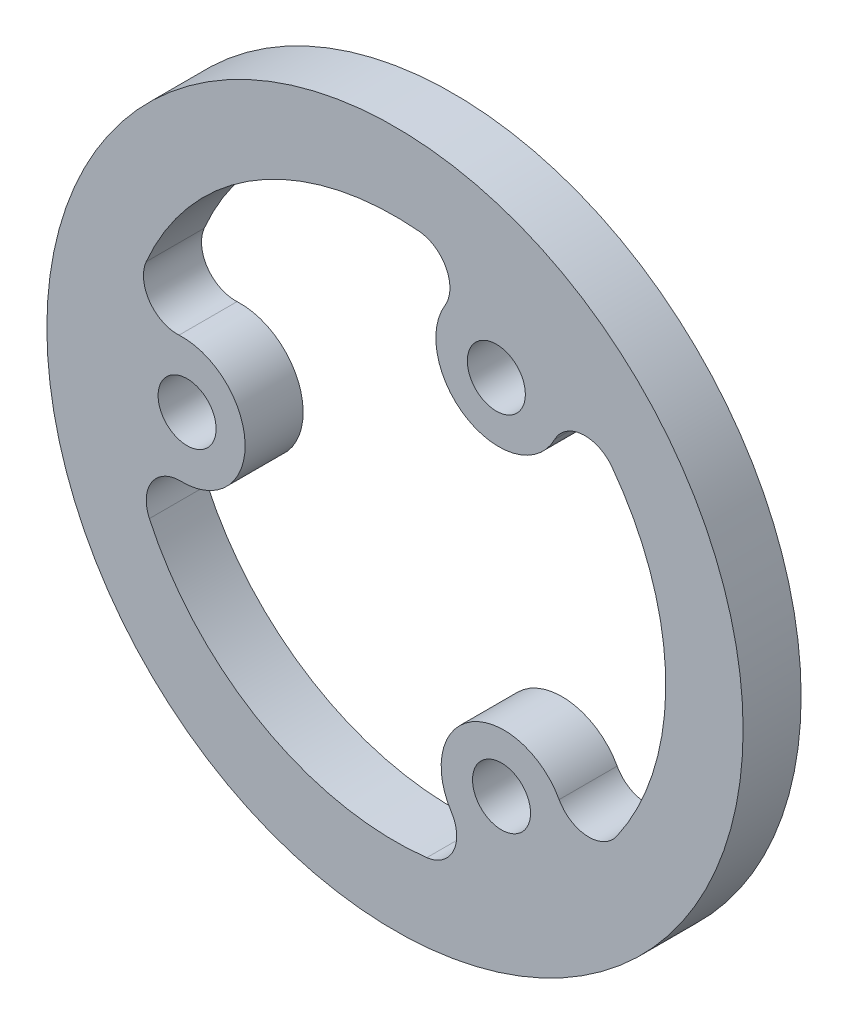
ISO-10303-21;
HEADER;
FILE_DESCRIPTION(('STEP AP214'),'2;1');
FILE_NAME('part.step','',(''),(''),'','','');
FILE_SCHEMA(('AUTOMOTIVE_DESIGN { 1 0 10303 214 1 1 1 1 }'));
ENDSEC;
DATA;
#1=APPLICATION_CONTEXT('core data for automotive mechanical design processes');
#2=APPLICATION_PROTOCOL_DEFINITION('international standard','automotive_design',2000,#1);
#3=PRODUCT_CONTEXT('',#1,'mechanical');
#4=PRODUCT('Part','Part','',(#3));
#5=PRODUCT_RELATED_PRODUCT_CATEGORY('part','',(#4));
#6=PRODUCT_DEFINITION_FORMATION('','',#4);
#7=PRODUCT_DEFINITION_CONTEXT('part definition',#1,'design');
#8=PRODUCT_DEFINITION('design','',#6,#7);
#9=PRODUCT_DEFINITION_SHAPE('','',#8);
#10=(LENGTH_UNIT() NAMED_UNIT(*) SI_UNIT(.MILLI.,.METRE.));
#11=(NAMED_UNIT(*) PLANE_ANGLE_UNIT() SI_UNIT($,.RADIAN.));
#12=(NAMED_UNIT(*) SI_UNIT($,.STERADIAN.) SOLID_ANGLE_UNIT());
#13=UNCERTAINTY_MEASURE_WITH_UNIT(LENGTH_MEASURE(1.E-05),#10,'distance_accuracy_value','');
#14=(GEOMETRIC_REPRESENTATION_CONTEXT(3) GLOBAL_UNCERTAINTY_ASSIGNED_CONTEXT((#13)) GLOBAL_UNIT_ASSIGNED_CONTEXT((#10,
#11,#12)) REPRESENTATION_CONTEXT('',''));
#15=CARTESIAN_POINT('',(0.,0.,0.));
#16=DIRECTION('',(0.,0.,1.));
#17=DIRECTION('',(1.,0.,0.));
#18=AXIS2_PLACEMENT_3D('',#15,#16,#17);
#19=CARTESIAN_POINT('',(0.,0.,3.));
#20=DIRECTION('',(0.,0.,1.));
#21=DIRECTION('',(1.,0.,0.));
#22=AXIS2_PLACEMENT_3D('',#19,#20,#21);
#23=PLANE('',#22);
#24=CARTESIAN_POINT('',(5.24045327565877,9.38616798622511,3.));
#25=DIRECTION('',(0.,0.,1.));
#26=DIRECTION('',(1.,0.,0.));
#27=AXIS2_PLACEMENT_3D('',#24,#25,#26);
#28=CIRCLE('',#27,1.49999999999964);
#29=CARTESIAN_POINT('',(6.74045327565841,9.38616798622511,3.));
#30=VERTEX_POINT('',#29);
#31=EDGE_CURVE('E168',#30,#30,#28,.T.);
#32=ORIENTED_EDGE('',*,*,#31,.F.);
#33=EDGE_LOOP('',(#32));
#34=FACE_BOUND('',#33,.T.);
#35=CARTESIAN_POINT('',(0.,0.,3.));
#36=DIRECTION('',(0.,0.,1.));
#37=DIRECTION('',(1.,0.,0.));
#38=AXIS2_PLACEMENT_3D('',#35,#36,#37);
#39=CIRCLE('',#38,18.);
#40=CARTESIAN_POINT('',(18.,0.,3.));
#41=VERTEX_POINT('',#40);
#42=EDGE_CURVE('E11',#41,#41,#39,.T.);
#43=ORIENTED_EDGE('',*,*,#42,.T.);
#44=EDGE_LOOP('',(#43));
#45=FACE_BOUND('',#44,.T.);
#46=CARTESIAN_POINT('',(5.5084332824298,-9.23144965717842,3.));
#47=DIRECTION('',(0.,0.,1.));
#48=DIRECTION('',(1.,0.,0.));
#49=AXIS2_PLACEMENT_3D('',#46,#47,#48);
#50=CIRCLE('',#49,1.49999999999968);
#51=CARTESIAN_POINT('',(7.00843328242948,-9.23144965717842,3.));
#52=VERTEX_POINT('',#51);
#53=EDGE_CURVE('E218',#52,#52,#50,.T.);
#54=ORIENTED_EDGE('',*,*,#53,.F.);
#55=EDGE_LOOP('',(#54));
#56=FACE_BOUND('',#55,.T.);
#57=CARTESIAN_POINT('',(5.63653638202138,-9.44613453292734,3.));
#58=DIRECTION('',(0.,0.,-1.));
#59=DIRECTION('',(1.,0.,0.));
#60=AXIS2_PLACEMENT_3D('',#57,#58,#59);
#61=CIRCLE('',#60,3.24999999999996);
#62=CARTESIAN_POINT('',(2.90904103089509,-11.2134118483434,3.));
#63=VERTEX_POINT('',#62);
#64=CARTESIAN_POINT('',(8.48703982309559,-7.88500349024585,3.));
#65=VERTEX_POINT('',#64);
#66=EDGE_CURVE('E130',#63,#65,#61,.T.);
#67=ORIENTED_EDGE('',*,*,#66,.F.);
#68=CARTESIAN_POINT('',(1.4403896879811,-12.1650227104908,3.));
#69=DIRECTION('',(0.,0.,1.));
#70=DIRECTION('',(1.,0.,0.));
#71=AXIS2_PLACEMENT_3D('',#68,#69,#70);
#72=CIRCLE('',#71,1.75000000000001);
#73=CARTESIAN_POINT('',(1.64615964340708,-13.9028830977038,3.));
#74=VERTEX_POINT('',#73);
#75=EDGE_CURVE('E122',#74,#63,#72,.T.);
#76=ORIENTED_EDGE('',*,*,#75,.F.);
#77=CARTESIAN_POINT('',(0.,0.,3.));
#78=DIRECTION('',(0.,0.,1.));
#79=DIRECTION('',(1.,0.,0.));
#80=AXIS2_PLACEMENT_3D('',#77,#78,#79);
#81=CIRCLE('',#80,14.);
#82=CARTESIAN_POINT('',(-12.6989573812711,-5.89376631948198,3.));
#83=VERTEX_POINT('',#82);
#84=EDGE_CURVE('E165',#83,#74,#81,.T.);
#85=ORIENTED_EDGE('',*,*,#84,.F.);
#86=CARTESIAN_POINT('',(-11.1115877086127,-5.15704552954634,3.));
#87=DIRECTION('',(0.,0.,1.));
#88=DIRECTION('',(1.,0.,0.));
#89=AXIS2_PLACEMENT_3D('',#86,#87,#88);
#90=CIRCLE('',#89,1.7499999999997);
#91=CARTESIAN_POINT('',(-11.0721332430297,-3.40749034460804,3.));
#92=VERTEX_POINT('',#91);
#93=EDGE_CURVE('E163',#92,#83,#90,.T.);
#94=ORIENTED_EDGE('',*,*,#93,.F.);
#95=CARTESIAN_POINT('',(-10.9988606640912,-0.158316429722068,3.));
#96=DIRECTION('',(0.,0.,-1.));
#97=DIRECTION('',(1.,0.,0.));
#98=AXIS2_PLACEMENT_3D('',#95,#96,#97);
#99=CIRCLE('',#98,3.24999999999996);
#100=CARTESIAN_POINT('',(-11.1656200392103,3.08740249076528,3.));
#101=VERTEX_POINT('',#100);
#102=EDGE_CURVE('E161',#101,#92,#99,.T.);
#103=ORIENTED_EDGE('',*,*,#102,.F.);
#104=CARTESIAN_POINT('',(-11.2554135488902,4.83509729410464,3.));
#105=DIRECTION('',(0.,0.,1.));
#106=DIRECTION('',(1.,0.,0.));
#107=AXIS2_PLACEMENT_3D('',#104,#105,#106);
#108=CIRCLE('',#107,1.75000000000001);
#109=CARTESIAN_POINT('',(-12.8633297701603,5.52582547897669,3.));
#110=VERTEX_POINT('',#109);
#111=EDGE_CURVE('E159',#110,#101,#108,.T.);
#112=ORIENTED_EDGE('',*,*,#111,.F.);
#113=CARTESIAN_POINT('',(0.,0.,3.));
#114=DIRECTION('',(0.,0.,1.));
#115=DIRECTION('',(1.,0.,0.));
#116=AXIS2_PLACEMENT_3D('',#113,#114,#115);
#117=CIRCLE('',#116,14.);
#118=CARTESIAN_POINT('',(1.24532733399512,13.9445028534977,3.));
#119=VERTEX_POINT('',#118);
#120=EDGE_CURVE('E157',#119,#110,#117,.T.);
#121=ORIENTED_EDGE('',*,*,#120,.F.);
#122=CARTESIAN_POINT('',(1.08966141724626,12.2014399968107,3.));
#123=DIRECTION('',(0.,0.,1.));
#124=DIRECTION('',(1.,0.,0.));
#125=AXIS2_PLACEMENT_3D('',#122,#123,#124);
#126=CIRCLE('',#125,1.7499999999997);
#127=CARTESIAN_POINT('',(2.58509341993399,11.2924938348539,3.));
#128=VERTEX_POINT('',#127);
#129=EDGE_CURVE('E155',#128,#119,#126,.T.);
#130=ORIENTED_EDGE('',*,*,#129,.F.);
#131=CARTESIAN_POINT('',(5.36232428206975,9.60445096264946,3.));
#132=DIRECTION('',(0.,0.,-1.));
#133=DIRECTION('',(1.,0.,0.));
#134=AXIS2_PLACEMENT_3D('',#131,#132,#133);
#135=CIRCLE('',#134,3.24999999999995);
#136=CARTESIAN_POINT('',(8.25657900831527,8.12600935757811,3.));
#137=VERTEX_POINT('',#136);
#138=EDGE_CURVE('E153',#137,#128,#135,.T.);
#139=ORIENTED_EDGE('',*,*,#138,.F.);
#140=CARTESIAN_POINT('',(9.81502386090915,7.32992541638618,3.));
#141=DIRECTION('',(0.,0.,1.));
#142=DIRECTION('',(1.,0.,0.));
#143=AXIS2_PLACEMENT_3D('',#140,#141,#142);
#144=CIRCLE('',#143,1.75000000000001);
#145=CARTESIAN_POINT('',(11.2171701267533,8.37705761872707,3.));
#146=VERTEX_POINT('',#145);
#147=EDGE_CURVE('E151',#146,#137,#144,.T.);
#148=ORIENTED_EDGE('',*,*,#147,.F.);
#149=CARTESIAN_POINT('',(0.,0.,3.));
#150=DIRECTION('',(0.,0.,1.));
#151=DIRECTION('',(1.,0.,0.));
#152=AXIS2_PLACEMENT_3D('',#149,#150,#151);
#153=CIRCLE('',#152,14.);
#154=CARTESIAN_POINT('',(11.4536300472761,-8.05073653401565,3.));
#155=VERTEX_POINT('',#154);
#156=EDGE_CURVE('E146',#155,#146,#153,.T.);
#157=ORIENTED_EDGE('',*,*,#156,.F.);
#158=CARTESIAN_POINT('',(10.0219262913665,-7.04439446726436,3.));
#159=DIRECTION('',(0.,0.,1.));
#160=DIRECTION('',(1.,0.,0.));
#161=AXIS2_PLACEMENT_3D('',#158,#159,#160);
#162=CIRCLE('',#161,1.7499999999997);
#163=EDGE_CURVE('E144',#65,#155,#162,.T.);
#164=ORIENTED_EDGE('',*,*,#163,.F.);
#165=EDGE_LOOP('',(#67,#76,#85,#94,#103,#112,#121,#130,#139,#148,#157,#164));
#166=FACE_BOUND('',#165,.T.);
#167=CARTESIAN_POINT('',(-10.7488865580886,-0.15471832904669,3.));
#168=DIRECTION('',(0.,0.,1.));
#169=DIRECTION('',(1.,0.,0.));
#170=AXIS2_PLACEMENT_3D('',#167,#168,#169);
#171=CIRCLE('',#170,1.49999999999971);
#172=CARTESIAN_POINT('',(-9.24888655808885,-0.15471832904669,3.));
#173=VERTEX_POINT('',#172);
#174=EDGE_CURVE('E262',#173,#173,#171,.T.);
#175=ORIENTED_EDGE('',*,*,#174,.F.);
#176=EDGE_LOOP('',(#175));
#177=FACE_BOUND('',#176,.T.);
#178=ADVANCED_FACE('F33',(#34,#45,#56,#166,#177),#23,.T.);
#179=CARTESIAN_POINT('',(0.,0.,0.));
#180=DIRECTION('',(0.,0.,1.));
#181=DIRECTION('',(1.,0.,0.));
#182=AXIS2_PLACEMENT_3D('',#179,#180,#181);
#183=PLANE('',#182);
#184=CARTESIAN_POINT('',(5.5084332824298,-9.23144965717842,0.));
#185=DIRECTION('',(0.,0.,1.));
#186=DIRECTION('',(1.,0.,0.));
#187=AXIS2_PLACEMENT_3D('',#184,#185,#186);
#188=CIRCLE('',#187,1.49999999999968);
#189=CARTESIAN_POINT('',(7.00843328242948,-9.23144965717842,0.));
#190=VERTEX_POINT('',#189);
#191=EDGE_CURVE('E138',#190,#190,#188,.T.);
#192=ORIENTED_EDGE('',*,*,#191,.T.);
#193=EDGE_LOOP('',(#192));
#194=FACE_BOUND('',#193,.T.);
#195=CARTESIAN_POINT('',(0.,0.,0.));
#196=DIRECTION('',(0.,0.,1.));
#197=DIRECTION('',(1.,0.,0.));
#198=AXIS2_PLACEMENT_3D('',#195,#196,#197);
#199=CIRCLE('',#198,18.);
#200=CARTESIAN_POINT('',(18.,0.,0.));
#201=VERTEX_POINT('',#200);
#202=EDGE_CURVE('E37',#201,#201,#199,.T.);
#203=ORIENTED_EDGE('',*,*,#202,.F.);
#204=EDGE_LOOP('',(#203));
#205=FACE_BOUND('',#204,.T.);
#206=CARTESIAN_POINT('',(1.4403896879811,-12.1650227104908,0.));
#207=DIRECTION('',(0.,0.,1.));
#208=DIRECTION('',(1.,0.,0.));
#209=AXIS2_PLACEMENT_3D('',#206,#207,#208);
#210=CIRCLE('',#209,1.75000000000001);
#211=CARTESIAN_POINT('',(1.64615964340708,-13.9028830977038,0.));
#212=VERTEX_POINT('',#211);
#213=CARTESIAN_POINT('',(2.90904103089509,-11.2134118483434,0.));
#214=VERTEX_POINT('',#213);
#215=EDGE_CURVE('E56',#212,#214,#210,.T.);
#216=ORIENTED_EDGE('',*,*,#215,.T.);
#217=CARTESIAN_POINT('',(5.63653638202138,-9.44613453292734,0.));
#218=DIRECTION('',(0.,0.,-1.));
#219=DIRECTION('',(1.,0.,0.));
#220=AXIS2_PLACEMENT_3D('',#217,#218,#219);
#221=CIRCLE('',#220,3.24999999999996);
#222=CARTESIAN_POINT('',(8.48703982309559,-7.88500349024585,0.));
#223=VERTEX_POINT('',#222);
#224=EDGE_CURVE('E137',#214,#223,#221,.T.);
#225=ORIENTED_EDGE('',*,*,#224,.T.);
#226=CARTESIAN_POINT('',(10.0219262913665,-7.04439446726436,0.));
#227=DIRECTION('',(0.,0.,1.));
#228=DIRECTION('',(1.,0.,0.));
#229=AXIS2_PLACEMENT_3D('',#226,#227,#228);
#230=CIRCLE('',#229,1.7499999999997);
#231=CARTESIAN_POINT('',(11.4536300472761,-8.05073653401565,0.));
#232=VERTEX_POINT('',#231);
#233=EDGE_CURVE('E170',#223,#232,#230,.T.);
#234=ORIENTED_EDGE('',*,*,#233,.T.);
#235=CARTESIAN_POINT('',(0.,0.,0.));
#236=DIRECTION('',(0.,0.,1.));
#237=DIRECTION('',(1.,0.,0.));
#238=AXIS2_PLACEMENT_3D('',#235,#236,#237);
#239=CIRCLE('',#238,14.);
#240=CARTESIAN_POINT('',(11.2171701267533,8.37705761872707,0.));
#241=VERTEX_POINT('',#240);
#242=EDGE_CURVE('E173',#232,#241,#239,.T.);
#243=ORIENTED_EDGE('',*,*,#242,.T.);
#244=CARTESIAN_POINT('',(9.81502386090915,7.32992541638618,0.));
#245=DIRECTION('',(0.,0.,1.));
#246=DIRECTION('',(1.,0.,0.));
#247=AXIS2_PLACEMENT_3D('',#244,#245,#246);
#248=CIRCLE('',#247,1.75000000000001);
#249=CARTESIAN_POINT('',(8.25657900831527,8.12600935757811,0.));
#250=VERTEX_POINT('',#249);
#251=EDGE_CURVE('E176',#241,#250,#248,.T.);
#252=ORIENTED_EDGE('',*,*,#251,.T.);
#253=CARTESIAN_POINT('',(5.36232428206975,9.60445096264946,0.));
#254=DIRECTION('',(0.,0.,-1.));
#255=DIRECTION('',(1.,0.,0.));
#256=AXIS2_PLACEMENT_3D('',#253,#254,#255);
#257=CIRCLE('',#256,3.24999999999995);
#258=CARTESIAN_POINT('',(2.58509341993399,11.2924938348539,0.));
#259=VERTEX_POINT('',#258);
#260=EDGE_CURVE('E179',#250,#259,#257,.T.);
#261=ORIENTED_EDGE('',*,*,#260,.T.);
#262=CARTESIAN_POINT('',(1.08966141724626,12.2014399968107,0.));
#263=DIRECTION('',(0.,0.,1.));
#264=DIRECTION('',(1.,0.,0.));
#265=AXIS2_PLACEMENT_3D('',#262,#263,#264);
#266=CIRCLE('',#265,1.7499999999997);
#267=CARTESIAN_POINT('',(1.24532733399512,13.9445028534977,0.));
#268=VERTEX_POINT('',#267);
#269=EDGE_CURVE('E182',#259,#268,#266,.T.);
#270=ORIENTED_EDGE('',*,*,#269,.T.);
#271=CARTESIAN_POINT('',(0.,0.,0.));
#272=DIRECTION('',(0.,0.,1.));
#273=DIRECTION('',(1.,0.,0.));
#274=AXIS2_PLACEMENT_3D('',#271,#272,#273);
#275=CIRCLE('',#274,14.);
#276=CARTESIAN_POINT('',(-12.8633297701603,5.52582547897669,0.));
#277=VERTEX_POINT('',#276);
#278=EDGE_CURVE('E185',#268,#277,#275,.T.);
#279=ORIENTED_EDGE('',*,*,#278,.T.);
#280=CARTESIAN_POINT('',(-11.2554135488902,4.83509729410464,0.));
#281=DIRECTION('',(0.,0.,1.));
#282=DIRECTION('',(1.,0.,0.));
#283=AXIS2_PLACEMENT_3D('',#280,#281,#282);
#284=CIRCLE('',#283,1.75000000000001);
#285=CARTESIAN_POINT('',(-11.1656200392103,3.08740249076528,0.));
#286=VERTEX_POINT('',#285);
#287=EDGE_CURVE('E188',#277,#286,#284,.T.);
#288=ORIENTED_EDGE('',*,*,#287,.T.);
#289=CARTESIAN_POINT('',(-10.9988606640912,-0.158316429722068,0.));
#290=DIRECTION('',(0.,0.,-1.));
#291=DIRECTION('',(1.,0.,0.));
#292=AXIS2_PLACEMENT_3D('',#289,#290,#291);
#293=CIRCLE('',#292,3.24999999999996);
#294=CARTESIAN_POINT('',(-11.0721332430297,-3.40749034460804,0.));
#295=VERTEX_POINT('',#294);
#296=EDGE_CURVE('E191',#286,#295,#293,.T.);
#297=ORIENTED_EDGE('',*,*,#296,.T.);
#298=CARTESIAN_POINT('',(-11.1115877086127,-5.15704552954634,0.));
#299=DIRECTION('',(0.,0.,1.));
#300=DIRECTION('',(1.,0.,0.));
#301=AXIS2_PLACEMENT_3D('',#298,#299,#300);
#302=CIRCLE('',#301,1.7499999999997);
#303=CARTESIAN_POINT('',(-12.6989573812711,-5.89376631948197,0.));
#304=VERTEX_POINT('',#303);
#305=EDGE_CURVE('E194',#295,#304,#302,.T.);
#306=ORIENTED_EDGE('',*,*,#305,.T.);
#307=CARTESIAN_POINT('',(0.,0.,0.));
#308=DIRECTION('',(0.,0.,1.));
#309=DIRECTION('',(1.,0.,0.));
#310=AXIS2_PLACEMENT_3D('',#307,#308,#309);
#311=CIRCLE('',#310,14.);
#312=EDGE_CURVE('E131',#304,#212,#311,.T.);
#313=ORIENTED_EDGE('',*,*,#312,.T.);
#314=EDGE_LOOP('',(#216,#225,#234,#243,#252,#261,#270,#279,#288,#297,#306,#313));
#315=FACE_BOUND('',#314,.T.);
#316=CARTESIAN_POINT('',(5.24045327565877,9.38616798622511,0.));
#317=DIRECTION('',(0.,0.,1.));
#318=DIRECTION('',(1.,0.,0.));
#319=AXIS2_PLACEMENT_3D('',#316,#317,#318);
#320=CIRCLE('',#319,1.49999999999964);
#321=CARTESIAN_POINT('',(6.74045327565841,9.38616798622511,0.));
#322=VERTEX_POINT('',#321);
#323=EDGE_CURVE('E257',#322,#322,#320,.T.);
#324=ORIENTED_EDGE('',*,*,#323,.T.);
#325=EDGE_LOOP('',(#324));
#326=FACE_BOUND('',#325,.T.);
#327=CARTESIAN_POINT('',(-10.7488865580886,-0.15471832904669,0.));
#328=DIRECTION('',(0.,0.,1.));
#329=DIRECTION('',(1.,0.,0.));
#330=AXIS2_PLACEMENT_3D('',#327,#328,#329);
#331=CIRCLE('',#330,1.49999999999971);
#332=CARTESIAN_POINT('',(-9.24888655808885,-0.15471832904669,0.));
#333=VERTEX_POINT('',#332);
#334=EDGE_CURVE('E260',#333,#333,#331,.T.);
#335=ORIENTED_EDGE('',*,*,#334,.T.);
#336=EDGE_LOOP('',(#335));
#337=FACE_BOUND('',#336,.T.);
#338=ADVANCED_FACE('F224',(#194,#205,#315,#326,#337),#183,.F.);
#339=CARTESIAN_POINT('',(0.,0.,3.));
#340=DIRECTION('',(0.,0.,-1.));
#341=DIRECTION('',(-1.,0.,0.));
#342=AXIS2_PLACEMENT_3D('',#339,#340,#341);
#343=CYLINDRICAL_SURFACE('',#342,18.);
#344=ORIENTED_EDGE('',*,*,#42,.F.);
#345=EDGE_LOOP('',(#344));
#346=FACE_BOUND('',#345,.T.);
#347=ORIENTED_EDGE('',*,*,#202,.T.);
#348=EDGE_LOOP('',(#347));
#349=FACE_BOUND('',#348,.T.);
#350=ADVANCED_FACE('F35',(#346,#349),#343,.T.);
#351=CARTESIAN_POINT('',(5.5084332824298,-9.23144965717842,3.));
#352=DIRECTION('',(0.,0.,-1.));
#353=DIRECTION('',(-1.,0.,0.));
#354=AXIS2_PLACEMENT_3D('',#351,#352,#353);
#355=CYLINDRICAL_SURFACE('',#354,1.49999999999968);
#356=ORIENTED_EDGE('',*,*,#53,.T.);
#357=EDGE_LOOP('',(#356));
#358=FACE_BOUND('',#357,.T.);
#359=ORIENTED_EDGE('',*,*,#191,.F.);
#360=EDGE_LOOP('',(#359));
#361=FACE_BOUND('',#360,.T.);
#362=ADVANCED_FACE('F227',(#358,#361),#355,.F.);
#363=CARTESIAN_POINT('',(1.4403896879811,-12.1650227104908,3.));
#364=DIRECTION('',(0.,0.,-1.));
#365=DIRECTION('',(-1.,0.,0.));
#366=AXIS2_PLACEMENT_3D('',#363,#364,#365);
#367=CYLINDRICAL_SURFACE('',#366,1.75000000000001);
#368=ORIENTED_EDGE('',*,*,#215,.F.);
#369=DIRECTION('',(0.,0.,-1.));
#370=VECTOR('',#369,1.);
#371=CARTESIAN_POINT('',(1.64615964340708,-13.9028830977038,3.));
#372=LINE('',#371,#370);
#373=EDGE_CURVE('E126',#74,#212,#372,.T.);
#374=ORIENTED_EDGE('',*,*,#373,.F.);
#375=ORIENTED_EDGE('',*,*,#75,.T.);
#376=DIRECTION('',(0.,0.,-1.));
#377=VECTOR('',#376,1.);
#378=CARTESIAN_POINT('',(2.90904103089509,-11.2134118483434,3.));
#379=LINE('',#378,#377);
#380=EDGE_CURVE('E125',#63,#214,#379,.T.);
#381=ORIENTED_EDGE('',*,*,#380,.T.);
#382=EDGE_LOOP('',(#368,#374,#375,#381));
#383=FACE_BOUND('',#382,.T.);
#384=ADVANCED_FACE('F124',(#383),#367,.F.);
#385=CARTESIAN_POINT('',(5.63653638202138,-9.44613453292734,3.));
#386=DIRECTION('',(0.,0.,-1.));
#387=DIRECTION('',(-1.,0.,0.));
#388=AXIS2_PLACEMENT_3D('',#385,#386,#387);
#389=CYLINDRICAL_SURFACE('',#388,3.24999999999996);
#390=ORIENTED_EDGE('',*,*,#224,.F.);
#391=ORIENTED_EDGE('',*,*,#380,.F.);
#392=ORIENTED_EDGE('',*,*,#66,.T.);
#393=DIRECTION('',(0.,0.,-1.));
#394=VECTOR('',#393,1.);
#395=CARTESIAN_POINT('',(8.48703982309559,-7.88500349024585,3.));
#396=LINE('',#395,#394);
#397=EDGE_CURVE('E139',#65,#223,#396,.T.);
#398=ORIENTED_EDGE('',*,*,#397,.T.);
#399=EDGE_LOOP('',(#390,#391,#392,#398));
#400=FACE_BOUND('',#399,.T.);
#401=ADVANCED_FACE('F134',(#400),#389,.T.);
#402=CARTESIAN_POINT('',(10.0219262913665,-7.04439446726436,3.));
#403=DIRECTION('',(0.,0.,-1.));
#404=DIRECTION('',(-1.,0.,0.));
#405=AXIS2_PLACEMENT_3D('',#402,#403,#404);
#406=CYLINDRICAL_SURFACE('',#405,1.7499999999997);
#407=ORIENTED_EDGE('',*,*,#233,.F.);
#408=ORIENTED_EDGE('',*,*,#397,.F.);
#409=ORIENTED_EDGE('',*,*,#163,.T.);
#410=DIRECTION('',(0.,0.,-1.));
#411=VECTOR('',#410,1.);
#412=CARTESIAN_POINT('',(11.4536300472761,-8.05073653401565,3.));
#413=LINE('',#412,#411);
#414=EDGE_CURVE('E215',#155,#232,#413,.T.);
#415=ORIENTED_EDGE('',*,*,#414,.T.);
#416=EDGE_LOOP('',(#407,#408,#409,#415));
#417=FACE_BOUND('',#416,.T.);
#418=ADVANCED_FACE('F313',(#417),#406,.F.);
#419=CARTESIAN_POINT('',(0.,0.,3.));
#420=DIRECTION('',(0.,0.,-1.));
#421=DIRECTION('',(-1.,0.,0.));
#422=AXIS2_PLACEMENT_3D('',#419,#420,#421);
#423=CYLINDRICAL_SURFACE('',#422,14.);
#424=ORIENTED_EDGE('',*,*,#242,.F.);
#425=ORIENTED_EDGE('',*,*,#414,.F.);
#426=ORIENTED_EDGE('',*,*,#156,.T.);
#427=DIRECTION('',(0.,0.,-1.));
#428=VECTOR('',#427,1.);
#429=CARTESIAN_POINT('',(11.2171701267533,8.37705761872707,3.));
#430=LINE('',#429,#428);
#431=EDGE_CURVE('E213',#146,#241,#430,.T.);
#432=ORIENTED_EDGE('',*,*,#431,.T.);
#433=EDGE_LOOP('',(#424,#425,#426,#432));
#434=FACE_BOUND('',#433,.T.);
#435=ADVANCED_FACE('F309',(#434),#423,.F.);
#436=CARTESIAN_POINT('',(9.81502386090915,7.32992541638618,3.));
#437=DIRECTION('',(0.,0.,-1.));
#438=DIRECTION('',(-1.,0.,0.));
#439=AXIS2_PLACEMENT_3D('',#436,#437,#438);
#440=CYLINDRICAL_SURFACE('',#439,1.75000000000001);
#441=ORIENTED_EDGE('',*,*,#251,.F.);
#442=ORIENTED_EDGE('',*,*,#431,.F.);
#443=ORIENTED_EDGE('',*,*,#147,.T.);
#444=DIRECTION('',(0.,0.,-1.));
#445=VECTOR('',#444,1.);
#446=CARTESIAN_POINT('',(8.25657900831527,8.12600935757811,3.));
#447=LINE('',#446,#445);
#448=EDGE_CURVE('E211',#137,#250,#447,.T.);
#449=ORIENTED_EDGE('',*,*,#448,.T.);
#450=EDGE_LOOP('',(#441,#442,#443,#449));
#451=FACE_BOUND('',#450,.T.);
#452=ADVANCED_FACE('F305',(#451),#440,.F.);
#453=CARTESIAN_POINT('',(5.36232428206975,9.60445096264946,3.));
#454=DIRECTION('',(0.,0.,-1.));
#455=DIRECTION('',(-1.,0.,0.));
#456=AXIS2_PLACEMENT_3D('',#453,#454,#455);
#457=CYLINDRICAL_SURFACE('',#456,3.24999999999995);
#458=ORIENTED_EDGE('',*,*,#260,.F.);
#459=ORIENTED_EDGE('',*,*,#448,.F.);
#460=ORIENTED_EDGE('',*,*,#138,.T.);
#461=DIRECTION('',(0.,0.,-1.));
#462=VECTOR('',#461,1.);
#463=CARTESIAN_POINT('',(2.58509341993399,11.2924938348539,3.));
#464=LINE('',#463,#462);
#465=EDGE_CURVE('E209',#128,#259,#464,.T.);
#466=ORIENTED_EDGE('',*,*,#465,.T.);
#467=EDGE_LOOP('',(#458,#459,#460,#466));
#468=FACE_BOUND('',#467,.T.);
#469=ADVANCED_FACE('F301',(#468),#457,.T.);
#470=CARTESIAN_POINT('',(1.08966141724626,12.2014399968107,3.));
#471=DIRECTION('',(0.,0.,-1.));
#472=DIRECTION('',(-1.,0.,0.));
#473=AXIS2_PLACEMENT_3D('',#470,#471,#472);
#474=CYLINDRICAL_SURFACE('',#473,1.7499999999997);
#475=ORIENTED_EDGE('',*,*,#269,.F.);
#476=ORIENTED_EDGE('',*,*,#465,.F.);
#477=ORIENTED_EDGE('',*,*,#129,.T.);
#478=DIRECTION('',(0.,0.,-1.));
#479=VECTOR('',#478,1.);
#480=CARTESIAN_POINT('',(1.24532733399512,13.9445028534977,3.));
#481=LINE('',#480,#479);
#482=EDGE_CURVE('E207',#119,#268,#481,.T.);
#483=ORIENTED_EDGE('',*,*,#482,.T.);
#484=EDGE_LOOP('',(#475,#476,#477,#483));
#485=FACE_BOUND('',#484,.T.);
#486=ADVANCED_FACE('F297',(#485),#474,.F.);
#487=CARTESIAN_POINT('',(0.,0.,3.));
#488=DIRECTION('',(0.,0.,-1.));
#489=DIRECTION('',(-1.,0.,0.));
#490=AXIS2_PLACEMENT_3D('',#487,#488,#489);
#491=CYLINDRICAL_SURFACE('',#490,14.);
#492=ORIENTED_EDGE('',*,*,#278,.F.);
#493=ORIENTED_EDGE('',*,*,#482,.F.);
#494=ORIENTED_EDGE('',*,*,#120,.T.);
#495=DIRECTION('',(0.,0.,-1.));
#496=VECTOR('',#495,1.);
#497=CARTESIAN_POINT('',(-12.8633297701603,5.52582547897669,3.));
#498=LINE('',#497,#496);
#499=EDGE_CURVE('E205',#110,#277,#498,.T.);
#500=ORIENTED_EDGE('',*,*,#499,.T.);
#501=EDGE_LOOP('',(#492,#493,#494,#500));
#502=FACE_BOUND('',#501,.T.);
#503=ADVANCED_FACE('F293',(#502),#491,.F.);
#504=CARTESIAN_POINT('',(-11.2554135488902,4.83509729410464,3.));
#505=DIRECTION('',(0.,0.,-1.));
#506=DIRECTION('',(-1.,0.,0.));
#507=AXIS2_PLACEMENT_3D('',#504,#505,#506);
#508=CYLINDRICAL_SURFACE('',#507,1.75000000000001);
#509=ORIENTED_EDGE('',*,*,#287,.F.);
#510=ORIENTED_EDGE('',*,*,#499,.F.);
#511=ORIENTED_EDGE('',*,*,#111,.T.);
#512=DIRECTION('',(0.,0.,-1.));
#513=VECTOR('',#512,1.);
#514=CARTESIAN_POINT('',(-11.1656200392103,3.08740249076528,3.));
#515=LINE('',#514,#513);
#516=EDGE_CURVE('E203',#101,#286,#515,.T.);
#517=ORIENTED_EDGE('',*,*,#516,.T.);
#518=EDGE_LOOP('',(#509,#510,#511,#517));
#519=FACE_BOUND('',#518,.T.);
#520=ADVANCED_FACE('F289',(#519),#508,.F.);
#521=CARTESIAN_POINT('',(-10.9988606640912,-0.158316429722068,3.));
#522=DIRECTION('',(0.,0.,-1.));
#523=DIRECTION('',(-1.,0.,0.));
#524=AXIS2_PLACEMENT_3D('',#521,#522,#523);
#525=CYLINDRICAL_SURFACE('',#524,3.24999999999996);
#526=ORIENTED_EDGE('',*,*,#296,.F.);
#527=ORIENTED_EDGE('',*,*,#516,.F.);
#528=ORIENTED_EDGE('',*,*,#102,.T.);
#529=DIRECTION('',(0.,0.,-1.));
#530=VECTOR('',#529,1.);
#531=CARTESIAN_POINT('',(-11.0721332430297,-3.40749034460804,3.));
#532=LINE('',#531,#530);
#533=EDGE_CURVE('E201',#92,#295,#532,.T.);
#534=ORIENTED_EDGE('',*,*,#533,.T.);
#535=EDGE_LOOP('',(#526,#527,#528,#534));
#536=FACE_BOUND('',#535,.T.);
#537=ADVANCED_FACE('F285',(#536),#525,.T.);
#538=CARTESIAN_POINT('',(-11.1115877086127,-5.15704552954634,3.));
#539=DIRECTION('',(0.,0.,-1.));
#540=DIRECTION('',(-1.,0.,0.));
#541=AXIS2_PLACEMENT_3D('',#538,#539,#540);
#542=CYLINDRICAL_SURFACE('',#541,1.7499999999997);
#543=ORIENTED_EDGE('',*,*,#305,.F.);
#544=ORIENTED_EDGE('',*,*,#533,.F.);
#545=ORIENTED_EDGE('',*,*,#93,.T.);
#546=DIRECTION('',(0.,0.,-1.));
#547=VECTOR('',#546,1.);
#548=CARTESIAN_POINT('',(-12.6989573812711,-5.89376631948197,3.));
#549=LINE('',#548,#547);
#550=EDGE_CURVE('E48',#83,#304,#549,.T.);
#551=ORIENTED_EDGE('',*,*,#550,.T.);
#552=EDGE_LOOP('',(#543,#544,#545,#551));
#553=FACE_BOUND('',#552,.T.);
#554=ADVANCED_FACE('F280',(#553),#542,.F.);
#555=CARTESIAN_POINT('',(0.,0.,3.));
#556=DIRECTION('',(0.,0.,-1.));
#557=DIRECTION('',(-1.,0.,0.));
#558=AXIS2_PLACEMENT_3D('',#555,#556,#557);
#559=CYLINDRICAL_SURFACE('',#558,14.);
#560=ORIENTED_EDGE('',*,*,#312,.F.);
#561=ORIENTED_EDGE('',*,*,#550,.F.);
#562=ORIENTED_EDGE('',*,*,#84,.T.);
#563=ORIENTED_EDGE('',*,*,#373,.T.);
#564=EDGE_LOOP('',(#560,#561,#562,#563));
#565=FACE_BOUND('',#564,.T.);
#566=ADVANCED_FACE('F272',(#565),#559,.F.);
#567=CARTESIAN_POINT('',(5.24045327565877,9.38616798622511,3.));
#568=DIRECTION('',(0.,0.,-1.));
#569=DIRECTION('',(-1.,0.,0.));
#570=AXIS2_PLACEMENT_3D('',#567,#568,#569);
#571=CYLINDRICAL_SURFACE('',#570,1.49999999999964);
#572=ORIENTED_EDGE('',*,*,#31,.T.);
#573=EDGE_LOOP('',(#572));
#574=FACE_BOUND('',#573,.T.);
#575=ORIENTED_EDGE('',*,*,#323,.F.);
#576=EDGE_LOOP('',(#575));
#577=FACE_BOUND('',#576,.T.);
#578=ADVANCED_FACE('F268',(#574,#577),#571,.F.);
#579=CARTESIAN_POINT('',(-10.7488865580886,-0.15471832904669,3.));
#580=DIRECTION('',(0.,0.,-1.));
#581=DIRECTION('',(-1.,0.,0.));
#582=AXIS2_PLACEMENT_3D('',#579,#580,#581);
#583=CYLINDRICAL_SURFACE('',#582,1.49999999999971);
#584=ORIENTED_EDGE('',*,*,#174,.T.);
#585=EDGE_LOOP('',(#584));
#586=FACE_BOUND('',#585,.T.);
#587=ORIENTED_EDGE('',*,*,#334,.F.);
#588=EDGE_LOOP('',(#587));
#589=FACE_BOUND('',#588,.T.);
#590=ADVANCED_FACE('F271',(#586,#589),#583,.F.);
#591=CLOSED_SHELL('',(#178,#338,#350,#362,#384,#401,#418,#435,#452,#469,#486,#503,#520,#537,
#554,#566,#578,#590));
#592=MANIFOLD_SOLID_BREP('B2',#591);
#593=ADVANCED_BREP_SHAPE_REPRESENTATION('',(#18,#592),#14);
#594=SHAPE_DEFINITION_REPRESENTATION(#9,#593);
ENDSEC;
END-ISO-10303-21;
